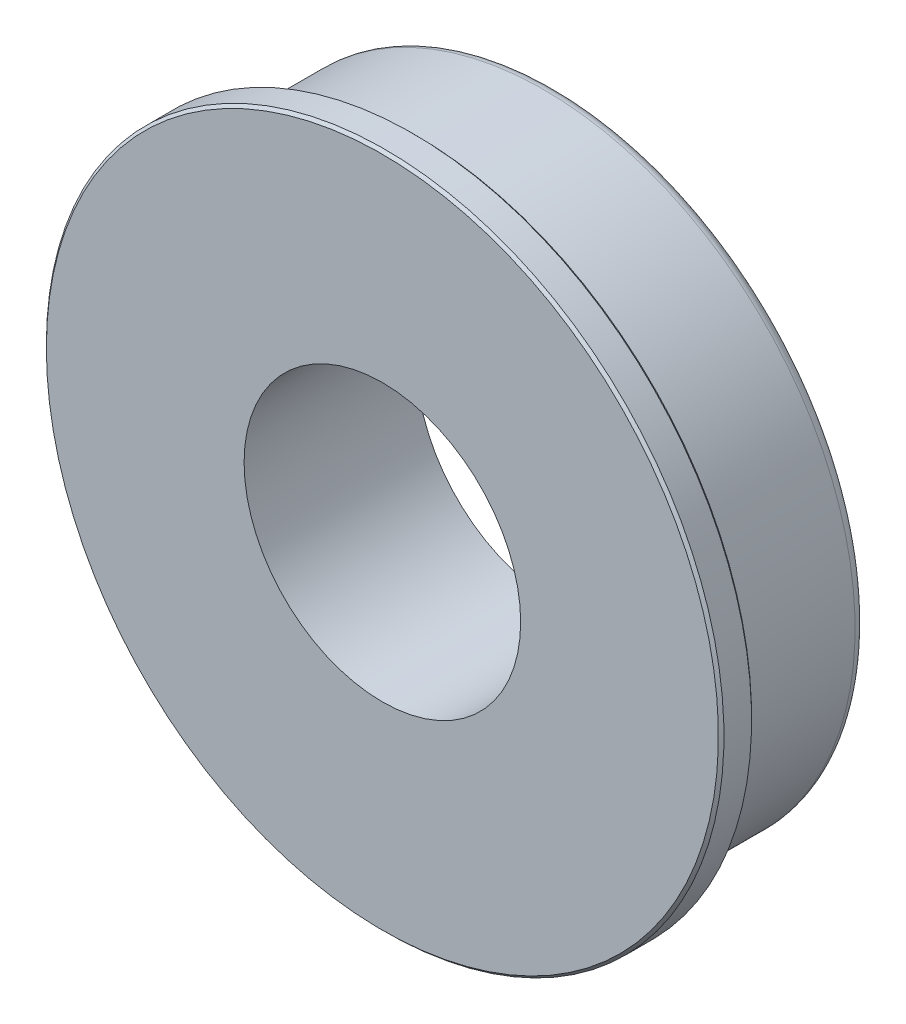
ISO-10303-21;
HEADER;
FILE_DESCRIPTION(('STEP AP214'),'2;1');
FILE_NAME('part.step','',(''),(''),'','','');
FILE_SCHEMA(('AUTOMOTIVE_DESIGN { 1 0 10303 214 1 1 1 1 }'));
ENDSEC;
DATA;
#1=APPLICATION_CONTEXT('core data for automotive mechanical design processes');
#2=APPLICATION_PROTOCOL_DEFINITION('international standard','automotive_design',2000,#1);
#3=PRODUCT_CONTEXT('',#1,'mechanical');
#4=PRODUCT('Part','Part','',(#3));
#5=PRODUCT_RELATED_PRODUCT_CATEGORY('part','',(#4));
#6=PRODUCT_DEFINITION_FORMATION('','',#4);
#7=PRODUCT_DEFINITION_CONTEXT('part definition',#1,'design');
#8=PRODUCT_DEFINITION('design','',#6,#7);
#9=PRODUCT_DEFINITION_SHAPE('','',#8);
#10=(LENGTH_UNIT() NAMED_UNIT(*) SI_UNIT(.MILLI.,.METRE.));
#11=(NAMED_UNIT(*) PLANE_ANGLE_UNIT() SI_UNIT($,.RADIAN.));
#12=(NAMED_UNIT(*) SI_UNIT($,.STERADIAN.) SOLID_ANGLE_UNIT());
#13=UNCERTAINTY_MEASURE_WITH_UNIT(LENGTH_MEASURE(1.E-05),#10,'distance_accuracy_value','');
#14=(GEOMETRIC_REPRESENTATION_CONTEXT(3) GLOBAL_UNCERTAINTY_ASSIGNED_CONTEXT((#13)) GLOBAL_UNIT_ASSIGNED_CONTEXT((#10,
#11,#12)) REPRESENTATION_CONTEXT('',''));
#15=CARTESIAN_POINT('',(0.,0.,0.));
#16=DIRECTION('',(0.,0.,1.));
#17=DIRECTION('',(1.,0.,0.));
#18=AXIS2_PLACEMENT_3D('',#15,#16,#17);
#19=CARTESIAN_POINT('',(0.,0.,0.508000000000006));
#20=DIRECTION('',(0.,0.,-1.));
#21=DIRECTION('',(-1.,0.,0.));
#22=AXIS2_PLACEMENT_3D('',#19,#20,#21);
#23=TOROIDAL_SURFACE('',#22,13.7795,0.508000000000002);
#24=CARTESIAN_POINT('',(0.,0.,0.508));
#25=DIRECTION('',(0.,0.,-1.));
#26=DIRECTION('',(-1.,0.,0.));
#27=AXIS2_PLACEMENT_3D('',#24,#25,#26);
#28=CIRCLE('',#27,14.2875);
#29=CARTESIAN_POINT('',(-14.2875,0.,0.508));
#30=VERTEX_POINT('',#29);
#31=EDGE_CURVE('E10',#30,#30,#28,.T.);
#32=ORIENTED_EDGE('',*,*,#31,.T.);
#33=EDGE_LOOP('',(#32));
#34=FACE_BOUND('',#33,.T.);
#35=CARTESIAN_POINT('',(0.,0.,0.));
#36=DIRECTION('',(0.,0.,-1.));
#37=DIRECTION('',(-1.,0.,0.));
#38=AXIS2_PLACEMENT_3D('',#35,#36,#37);
#39=CIRCLE('',#38,13.7795);
#40=CARTESIAN_POINT('',(-13.7795,0.,0.));
#41=VERTEX_POINT('',#40);
#42=EDGE_CURVE('E69',#41,#41,#39,.T.);
#43=ORIENTED_EDGE('',*,*,#42,.F.);
#44=EDGE_LOOP('',(#43));
#45=FACE_BOUND('',#44,.T.);
#46=ADVANCED_FACE('F32',(#34,#45),#23,.T.);
#47=CARTESIAN_POINT('',(0.,0.,7.92734));
#48=DIRECTION('',(0.,0.,-1.));
#49=DIRECTION('',(-1.,0.,0.));
#50=AXIS2_PLACEMENT_3D('',#47,#48,#49);
#51=CYLINDRICAL_SURFACE('',#50,14.2875);
#52=CARTESIAN_POINT('',(0.,0.,5.89534));
#53=DIRECTION('',(0.,0.,-1.));
#54=DIRECTION('',(-1.,0.,0.));
#55=AXIS2_PLACEMENT_3D('',#52,#53,#54);
#56=CIRCLE('',#55,14.2875);
#57=CARTESIAN_POINT('',(-14.2875,0.,5.89534));
#58=VERTEX_POINT('',#57);
#59=EDGE_CURVE('E38',#58,#58,#56,.T.);
#60=ORIENTED_EDGE('',*,*,#59,.T.);
#61=EDGE_LOOP('',(#60));
#62=FACE_BOUND('',#61,.T.);
#63=ORIENTED_EDGE('',*,*,#31,.F.);
#64=EDGE_LOOP('',(#63));
#65=FACE_BOUND('',#64,.T.);
#66=ADVANCED_FACE('F77',(#62,#65),#51,.T.);
#67=CARTESIAN_POINT('',(14.2875,0.,5.89534000000001));
#68=DIRECTION('',(0.,0.,1.));
#69=DIRECTION('',(1.,0.,0.));
#70=AXIS2_PLACEMENT_3D('',#67,#68,#69);
#71=PLANE('',#70);
#72=CARTESIAN_POINT('',(0.,0.,5.89534000000002));
#73=DIRECTION('',(0.,0.,-1.));
#74=DIRECTION('',(-1.,0.,0.));
#75=AXIS2_PLACEMENT_3D('',#72,#73,#74);
#76=CIRCLE('',#75,13.9699999999997);
#77=CARTESIAN_POINT('',(-13.9699999999997,0.,5.89534000000002));
#78=VERTEX_POINT('',#77);
#79=EDGE_CURVE('E42',#78,#78,#76,.T.);
#80=ORIENTED_EDGE('',*,*,#79,.T.);
#81=EDGE_LOOP('',(#80));
#82=FACE_BOUND('',#81,.T.);
#83=ORIENTED_EDGE('',*,*,#59,.F.);
#84=EDGE_LOOP('',(#83));
#85=FACE_BOUND('',#84,.T.);
#86=ADVANCED_FACE('F81',(#82,#85),#71,.T.);
#87=CARTESIAN_POINT('',(0.,0.,7.92734));
#88=DIRECTION('',(0.,0.,-1.));
#89=DIRECTION('',(-1.,0.,0.));
#90=AXIS2_PLACEMENT_3D('',#87,#88,#89);
#91=CYLINDRICAL_SURFACE('',#90,13.9699999999997);
#92=CARTESIAN_POINT('',(0.,0.,6.40334000000001));
#93=DIRECTION('',(0.,0.,-1.));
#94=DIRECTION('',(-1.,0.,0.));
#95=AXIS2_PLACEMENT_3D('',#92,#93,#94);
#96=CIRCLE('',#95,13.9699999999997);
#97=CARTESIAN_POINT('',(-13.9699999999997,0.,6.40334000000001));
#98=VERTEX_POINT('',#97);
#99=EDGE_CURVE('E46',#98,#98,#96,.T.);
#100=ORIENTED_EDGE('',*,*,#99,.T.);
#101=EDGE_LOOP('',(#100));
#102=FACE_BOUND('',#101,.T.);
#103=ORIENTED_EDGE('',*,*,#79,.F.);
#104=EDGE_LOOP('',(#103));
#105=FACE_BOUND('',#104,.T.);
#106=ADVANCED_FACE('F85',(#102,#105),#91,.T.);
#107=CARTESIAN_POINT('',(13.9699999999997,0.,6.40334000000001));
#108=DIRECTION('',(0.,0.,-1.));
#109=DIRECTION('',(-1.,0.,0.));
#110=AXIS2_PLACEMENT_3D('',#107,#108,#109);
#111=PLANE('',#110);
#112=CARTESIAN_POINT('',(0.,0.,6.40334000000001));
#113=DIRECTION('',(0.,0.,-1.));
#114=DIRECTION('',(-1.,0.,0.));
#115=AXIS2_PLACEMENT_3D('',#112,#113,#114);
#116=CIRCLE('',#115,15.4304999999997);
#117=CARTESIAN_POINT('',(-15.4304999999997,0.,6.40334000000001));
#118=VERTEX_POINT('',#117);
#119=EDGE_CURVE('E51',#118,#118,#116,.T.);
#120=ORIENTED_EDGE('',*,*,#119,.T.);
#121=EDGE_LOOP('',(#120));
#122=FACE_BOUND('',#121,.T.);
#123=ORIENTED_EDGE('',*,*,#99,.F.);
#124=EDGE_LOOP('',(#123));
#125=FACE_BOUND('',#124,.T.);
#126=ADVANCED_FACE('F92',(#122,#125),#111,.T.);
#127=CARTESIAN_POINT('',(0.,0.,6.40334000000001));
#128=DIRECTION('',(0.,0.,1.));
#129=DIRECTION('',(1.,0.,0.));
#130=AXIS2_PLACEMENT_3D('',#127,#128,#129);
#131=CONICAL_SURFACE('',#130,15.4304999999997,0.785398163397445);
#132=CARTESIAN_POINT('',(0.,0.,6.53034000000001));
#133=DIRECTION('',(0.,0.,-1.));
#134=DIRECTION('',(-1.,0.,0.));
#135=AXIS2_PLACEMENT_3D('',#132,#133,#134);
#136=CIRCLE('',#135,15.5574999999997);
#137=CARTESIAN_POINT('',(-15.5574999999997,0.,6.53034000000001));
#138=VERTEX_POINT('',#137);
#139=EDGE_CURVE('E54',#138,#138,#136,.T.);
#140=ORIENTED_EDGE('',*,*,#139,.T.);
#141=EDGE_LOOP('',(#140));
#142=FACE_BOUND('',#141,.T.);
#143=ORIENTED_EDGE('',*,*,#119,.F.);
#144=EDGE_LOOP('',(#143));
#145=FACE_BOUND('',#144,.T.);
#146=ADVANCED_FACE('F96',(#142,#145),#131,.T.);
#147=CARTESIAN_POINT('',(0.,0.,7.92734));
#148=DIRECTION('',(0.,0.,-1.));
#149=DIRECTION('',(-1.,0.,0.));
#150=AXIS2_PLACEMENT_3D('',#147,#148,#149);
#151=CYLINDRICAL_SURFACE('',#150,15.5574999999997);
#152=CARTESIAN_POINT('',(0.,0.,7.80034));
#153=DIRECTION('',(0.,0.,-1.));
#154=DIRECTION('',(-1.,0.,0.));
#155=AXIS2_PLACEMENT_3D('',#152,#153,#154);
#156=CIRCLE('',#155,15.5574999999997);
#157=CARTESIAN_POINT('',(-15.5574999999997,0.,7.80034));
#158=VERTEX_POINT('',#157);
#159=EDGE_CURVE('E57',#158,#158,#156,.T.);
#160=ORIENTED_EDGE('',*,*,#159,.T.);
#161=EDGE_LOOP('',(#160));
#162=FACE_BOUND('',#161,.T.);
#163=ORIENTED_EDGE('',*,*,#139,.F.);
#164=EDGE_LOOP('',(#163));
#165=FACE_BOUND('',#164,.T.);
#166=ADVANCED_FACE('F100',(#162,#165),#151,.T.);
#167=CARTESIAN_POINT('',(0.,0.,7.80034));
#168=DIRECTION('',(0.,0.,-1.));
#169=DIRECTION('',(-1.,0.,0.));
#170=AXIS2_PLACEMENT_3D('',#167,#168,#169);
#171=CONICAL_SURFACE('',#170,15.5574999999997,0.785398163397448);
#172=CARTESIAN_POINT('',(0.,0.,7.92734));
#173=DIRECTION('',(0.,0.,-1.));
#174=DIRECTION('',(-1.,0.,0.));
#175=AXIS2_PLACEMENT_3D('',#172,#173,#174);
#176=CIRCLE('',#175,15.4304999999997);
#177=CARTESIAN_POINT('',(-15.4304999999997,0.,7.92734));
#178=VERTEX_POINT('',#177);
#179=EDGE_CURVE('E60',#178,#178,#176,.T.);
#180=ORIENTED_EDGE('',*,*,#179,.T.);
#181=EDGE_LOOP('',(#180));
#182=FACE_BOUND('',#181,.T.);
#183=ORIENTED_EDGE('',*,*,#159,.F.);
#184=EDGE_LOOP('',(#183));
#185=FACE_BOUND('',#184,.T.);
#186=ADVANCED_FACE('F104',(#182,#185),#171,.T.);
#187=CARTESIAN_POINT('',(15.4304999999997,0.,7.92734));
#188=DIRECTION('',(0.,0.,1.));
#189=DIRECTION('',(1.,0.,0.));
#190=AXIS2_PLACEMENT_3D('',#187,#188,#189);
#191=PLANE('',#190);
#192=CARTESIAN_POINT('',(0.,0.,7.92734));
#193=DIRECTION('',(0.,0.,-1.));
#194=DIRECTION('',(-1.,0.,0.));
#195=AXIS2_PLACEMENT_3D('',#192,#193,#194);
#196=CIRCLE('',#195,6.35000000000001);
#197=CARTESIAN_POINT('',(-6.35000000000001,0.,7.92734));
#198=VERTEX_POINT('',#197);
#199=EDGE_CURVE('E63',#198,#198,#196,.T.);
#200=ORIENTED_EDGE('',*,*,#199,.T.);
#201=EDGE_LOOP('',(#200));
#202=FACE_BOUND('',#201,.T.);
#203=ORIENTED_EDGE('',*,*,#179,.F.);
#204=EDGE_LOOP('',(#203));
#205=FACE_BOUND('',#204,.T.);
#206=ADVANCED_FACE('F108',(#202,#205),#191,.T.);
#207=CARTESIAN_POINT('',(0.,0.,7.92734));
#208=DIRECTION('',(0.,0.,-1.));
#209=DIRECTION('',(-1.,0.,0.));
#210=AXIS2_PLACEMENT_3D('',#207,#208,#209);
#211=CYLINDRICAL_SURFACE('',#210,6.35000000000001);
#212=CARTESIAN_POINT('',(0.,0.,0.));
#213=DIRECTION('',(0.,0.,-1.));
#214=DIRECTION('',(-1.,0.,0.));
#215=AXIS2_PLACEMENT_3D('',#212,#213,#214);
#216=CIRCLE('',#215,6.35000000000001);
#217=CARTESIAN_POINT('',(-6.35000000000001,0.,0.));
#218=VERTEX_POINT('',#217);
#219=EDGE_CURVE('E66',#218,#218,#216,.T.);
#220=ORIENTED_EDGE('',*,*,#219,.T.);
#221=EDGE_LOOP('',(#220));
#222=FACE_BOUND('',#221,.T.);
#223=ORIENTED_EDGE('',*,*,#199,.F.);
#224=EDGE_LOOP('',(#223));
#225=FACE_BOUND('',#224,.T.);
#226=ADVANCED_FACE('F112',(#222,#225),#211,.F.);
#227=CARTESIAN_POINT('',(6.35000000000001,0.,0.));
#228=DIRECTION('',(0.,0.,-1.));
#229=DIRECTION('',(-1.,0.,0.));
#230=AXIS2_PLACEMENT_3D('',#227,#228,#229);
#231=PLANE('',#230);
#232=ORIENTED_EDGE('',*,*,#42,.T.);
#233=EDGE_LOOP('',(#232));
#234=FACE_BOUND('',#233,.T.);
#235=ORIENTED_EDGE('',*,*,#219,.F.);
#236=EDGE_LOOP('',(#235));
#237=FACE_BOUND('',#236,.T.);
#238=ADVANCED_FACE('F73',(#234,#237),#231,.T.);
#239=CLOSED_SHELL('',(#46,#66,#86,#106,#126,#146,#166,#186,#206,#226,#238));
#240=MANIFOLD_SOLID_BREP('B2',#239);
#241=ADVANCED_BREP_SHAPE_REPRESENTATION('',(#18,#240),#14);
#242=SHAPE_DEFINITION_REPRESENTATION(#9,#241);
ENDSEC;
END-ISO-10303-21;
